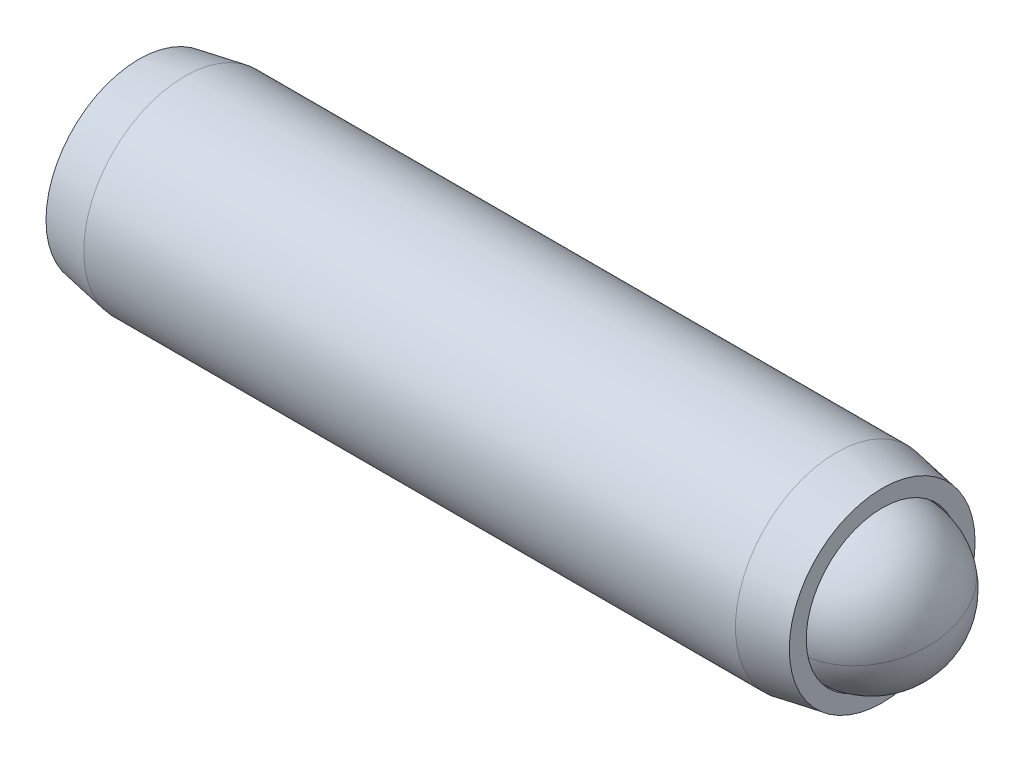
ISO-10303-21;
HEADER;
FILE_DESCRIPTION(('STEP AP214'),'2;1');
FILE_NAME('part.step','',(''),(''),'','','');
FILE_SCHEMA(('AUTOMOTIVE_DESIGN { 1 0 10303 214 1 1 1 1 }'));
ENDSEC;
DATA;
#1=APPLICATION_CONTEXT('core data for automotive mechanical design processes');
#2=APPLICATION_PROTOCOL_DEFINITION('international standard','automotive_design',2000,#1);
#3=PRODUCT_CONTEXT('',#1,'mechanical');
#4=PRODUCT('Part','Part','',(#3));
#5=PRODUCT_RELATED_PRODUCT_CATEGORY('part','',(#4));
#6=PRODUCT_DEFINITION_FORMATION('','',#4);
#7=PRODUCT_DEFINITION_CONTEXT('part definition',#1,'design');
#8=PRODUCT_DEFINITION('design','',#6,#7);
#9=PRODUCT_DEFINITION_SHAPE('','',#8);
#10=(LENGTH_UNIT() NAMED_UNIT(*) SI_UNIT(.MILLI.,.METRE.));
#11=(NAMED_UNIT(*) PLANE_ANGLE_UNIT() SI_UNIT($,.RADIAN.));
#12=(NAMED_UNIT(*) SI_UNIT($,.STERADIAN.) SOLID_ANGLE_UNIT());
#13=UNCERTAINTY_MEASURE_WITH_UNIT(LENGTH_MEASURE(1.E-05),#10,'distance_accuracy_value','');
#14=(GEOMETRIC_REPRESENTATION_CONTEXT(3) GLOBAL_UNCERTAINTY_ASSIGNED_CONTEXT((#13)) GLOBAL_UNIT_ASSIGNED_CONTEXT((#10,
#11,#12)) REPRESENTATION_CONTEXT('',''));
#15=CARTESIAN_POINT('',(0.,0.,0.));
#16=DIRECTION('',(0.,0.,1.));
#17=DIRECTION('',(1.,0.,0.));
#18=AXIS2_PLACEMENT_3D('',#15,#16,#17);
#19=CARTESIAN_POINT('',(5.24980800757996,2.7420499882851,-0.965131231055238));
#20=DIRECTION('',(1.,0.,0.));
#21=DIRECTION('',(0.,1.,0.));
#22=AXIS2_PLACEMENT_3D('',#19,#20,#21);
#23=CONICAL_SURFACE('',#22,0.,0.78539816339745);
#24=CARTESIAN_POINT('',(7.63740800757996,2.7420499882851,-0.965131231055238));
#25=DIRECTION('',(1.,0.,0.));
#26=DIRECTION('',(0.,1.,0.));
#27=AXIS2_PLACEMENT_3D('',#24,#25,#26);
#28=CIRCLE('',#27,2.3876);
#29=CARTESIAN_POINT('',(7.63740800757996,5.1296499882851,-0.965131231055238));
#30=VERTEX_POINT('',#29);
#31=EDGE_CURVE('P0_E149',#30,#30,#28,.T.);
#32=ORIENTED_EDGE('',*,*,#31,.T.);
#33=EDGE_LOOP('',(#32));
#34=FACE_BOUND('',#33,.T.);
#35=CARTESIAN_POINT('',(5.24980800757996,2.7420499882851,-0.965131231055238));
#36=VERTEX_POINT('',#35);
#37=VERTEX_LOOP('',#36);
#38=FACE_BOUND('',#37,.T.);
#39=ADVANCED_FACE('P0_F16',(#34,#38),#23,.F.);
#40=CARTESIAN_POINT('',(5.24980800757996,2.7420499882851,-0.965131231055238));
#41=DIRECTION('',(1.,0.,0.));
#42=DIRECTION('',(0.,1.,0.));
#43=AXIS2_PLACEMENT_3D('',#40,#41,#42);
#44=CYLINDRICAL_SURFACE('',#43,2.3876);
#45=CARTESIAN_POINT('',(8.96665405298089,2.7420499882851,-0.965131231055238));
#46=DIRECTION('',(1.,0.,0.));
#47=DIRECTION('',(0.,1.,0.));
#48=AXIS2_PLACEMENT_3D('',#45,#46,#47);
#49=CIRCLE('',#48,2.3876);
#50=CARTESIAN_POINT('',(8.96665405298089,5.1296499882851,-0.965131231055238));
#51=VERTEX_POINT('',#50);
#52=EDGE_CURVE('P0_E146',#51,#51,#49,.T.);
#53=ORIENTED_EDGE('',*,*,#52,.T.);
#54=EDGE_LOOP('',(#53));
#55=FACE_BOUND('',#54,.T.);
#56=ORIENTED_EDGE('',*,*,#31,.F.);
#57=EDGE_LOOP('',(#56));
#58=FACE_BOUND('',#57,.T.);
#59=ADVANCED_FACE('P0_F224',(#55,#58),#44,.F.);
#60=CARTESIAN_POINT('',(8.96665405298089,5.66304998828509,-0.965131231055238));
#61=DIRECTION('',(1.,0.,0.));
#62=DIRECTION('',(0.,1.,0.));
#63=AXIS2_PLACEMENT_3D('',#60,#61,#62);
#64=PLANE('',#63);
#65=CARTESIAN_POINT('',(8.96665405298089,2.7420499882851,-0.965131231055238));
#66=DIRECTION('',(1.,0.,0.));
#67=DIRECTION('',(0.,1.,0.));
#68=AXIS2_PLACEMENT_3D('',#65,#66,#67);
#69=CIRCLE('',#68,2.921);
#70=CARTESIAN_POINT('',(8.96665405298089,5.66304998828509,-0.965131231055238));
#71=VERTEX_POINT('',#70);
#72=EDGE_CURVE('P0_E143',#71,#71,#69,.T.);
#73=ORIENTED_EDGE('',*,*,#72,.T.);
#74=EDGE_LOOP('',(#73));
#75=FACE_BOUND('',#74,.T.);
#76=ORIENTED_EDGE('',*,*,#52,.F.);
#77=EDGE_LOOP('',(#76));
#78=FACE_BOUND('',#77,.T.);
#79=ADVANCED_FACE('P0_F230',(#75,#78),#64,.T.);
#80=CARTESIAN_POINT('',(8.96665405298089,2.7420499882851,-0.965131231055238));
#81=DIRECTION('',(-1.,0.,0.));
#82=DIRECTION('',(0.,-1.,0.));
#83=AXIS2_PLACEMENT_3D('',#80,#81,#82);
#84=CONICAL_SURFACE('',#83,2.921,0.174532925199434);
#85=CARTESIAN_POINT('',(7.526148470798,2.7420499882851,-0.965131231055238));
#86=DIRECTION('',(1.,0.,0.));
#87=DIRECTION('',(0.,1.,0.));
#88=AXIS2_PLACEMENT_3D('',#85,#86,#87);
#89=CIRCLE('',#88,3.175);
#90=CARTESIAN_POINT('',(7.526148470798,5.91704998828509,-0.965131231055238));
#91=VERTEX_POINT('',#90);
#92=EDGE_CURVE('P0_E140',#91,#91,#89,.T.);
#93=ORIENTED_EDGE('',*,*,#92,.T.);
#94=EDGE_LOOP('',(#93));
#95=FACE_BOUND('',#94,.T.);
#96=ORIENTED_EDGE('',*,*,#72,.F.);
#97=EDGE_LOOP('',(#96));
#98=FACE_BOUND('',#97,.T.);
#99=ADVANCED_FACE('P0_F274',(#95,#98),#84,.T.);
#100=CARTESIAN_POINT('',(5.24980800757996,2.7420499882851,-0.965131231055238));
#101=DIRECTION('',(1.,0.,0.));
#102=DIRECTION('',(0.,1.,0.));
#103=AXIS2_PLACEMENT_3D('',#100,#101,#102);
#104=CYLINDRICAL_SURFACE('',#103,3.175);
#105=CARTESIAN_POINT('',(-12.9608403648362,2.74204998828509,-0.965131231055238));
#106=DIRECTION('',(1.,0.,0.));
#107=DIRECTION('',(0.,1.,0.));
#108=AXIS2_PLACEMENT_3D('',#105,#106,#107);
#109=CIRCLE('',#108,3.175);
#110=CARTESIAN_POINT('',(-12.9608403648362,5.91704998828509,-0.965131231055238));
#111=VERTEX_POINT('',#110);
#112=EDGE_CURVE('P0_E137',#111,#111,#109,.T.);
#113=ORIENTED_EDGE('',*,*,#112,.T.);
#114=EDGE_LOOP('',(#113));
#115=FACE_BOUND('',#114,.T.);
#116=ORIENTED_EDGE('',*,*,#92,.F.);
#117=EDGE_LOOP('',(#116));
#118=FACE_BOUND('',#117,.T.);
#119=ADVANCED_FACE('P0_F270',(#115,#118),#104,.T.);
#120=CARTESIAN_POINT('',(-12.9608403648362,2.74204998828509,-0.965131231055238));
#121=DIRECTION('',(1.,0.,0.));
#122=DIRECTION('',(0.,1.,0.));
#123=AXIS2_PLACEMENT_3D('',#120,#121,#122);
#124=CONICAL_SURFACE('',#123,3.175,0.174532925199434);
#125=CARTESIAN_POINT('',(-14.4013459470191,2.74204998828509,-0.965131231055238));
#126=DIRECTION('',(1.,0.,0.));
#127=DIRECTION('',(0.,1.,0.));
#128=AXIS2_PLACEMENT_3D('',#125,#126,#127);
#129=CIRCLE('',#128,2.921);
#130=CARTESIAN_POINT('',(-14.4013459470191,5.66304998828509,-0.965131231055238));
#131=VERTEX_POINT('',#130);
#132=EDGE_CURVE('P0_E125',#131,#131,#129,.T.);
#133=ORIENTED_EDGE('',*,*,#132,.T.);
#134=EDGE_LOOP('',(#133));
#135=FACE_BOUND('',#134,.T.);
#136=ORIENTED_EDGE('',*,*,#112,.F.);
#137=EDGE_LOOP('',(#136));
#138=FACE_BOUND('',#137,.T.);
#139=ADVANCED_FACE('P0_F266',(#135,#138),#124,.T.);
#140=CARTESIAN_POINT('',(-14.4013459470191,2.74204998828509,-0.965131231055238));
#141=DIRECTION('',(-1.,0.,0.));
#142=DIRECTION('',(0.,-1.,0.));
#143=AXIS2_PLACEMENT_3D('',#140,#141,#142);
#144=PLANE('',#143);
#145=DIRECTION('',(0.,0.866025403784439,-0.5));
#146=VECTOR('',#145,1.);
#147=CARTESIAN_POINT('',(-14.4013459470191,2.6150499882851,-2.33078112403965));
#148=LINE('',#147,#146);
#149=CARTESIAN_POINT('',(-14.4013459470191,1.49586248828509,-1.68461791964099));
#150=VERTEX_POINT('',#149);
#151=CARTESIAN_POINT('',(-14.4013459470191,2.7420499882851,-2.40410460822673));
#152=VERTEX_POINT('',#151);
#153=EDGE_CURVE('P0_E163',#150,#152,#148,.T.);
#154=ORIENTED_EDGE('',*,*,#153,.T.);
#155=DIRECTION('',(0.,0.866025403784439,0.5));
#156=VECTOR('',#155,1.);
#157=CARTESIAN_POINT('',(-14.4013459470191,3.8612374882851,-1.75794140382807));
#158=LINE('',#157,#156);
#159=CARTESIAN_POINT('',(-14.4013459470191,3.9882374882851,-1.68461791964099));
#160=VERTEX_POINT('',#159);
#161=EDGE_CURVE('P0_E165',#152,#160,#158,.T.);
#162=ORIENTED_EDGE('',*,*,#161,.T.);
#163=DIRECTION('',(0.,0.,1.));
#164=VECTOR('',#163,1.);
#165=CARTESIAN_POINT('',(-14.4013459470191,3.9882374882851,-0.392291510843657));
#166=LINE('',#165,#164);
#167=CARTESIAN_POINT('',(-14.4013459470191,3.9882374882851,-0.245644542469492));
#168=VERTEX_POINT('',#167);
#169=EDGE_CURVE('P0_E155',#160,#168,#166,.T.);
#170=ORIENTED_EDGE('',*,*,#169,.T.);
#171=DIRECTION('',(0.,-0.866025403784438,0.5));
#172=VECTOR('',#171,1.);
#173=CARTESIAN_POINT('',(-14.4013459470191,2.8690499882851,0.400518661929173));
#174=LINE('',#173,#172);
#175=CARTESIAN_POINT('',(-14.4013459470191,2.7420499882851,0.473842146116256));
#176=VERTEX_POINT('',#175);
#177=EDGE_CURVE('P0_E157',#168,#176,#174,.T.);
#178=ORIENTED_EDGE('',*,*,#177,.T.);
#179=DIRECTION('',(0.,-0.866025403784439,-0.5));
#180=VECTOR('',#179,1.);
#181=CARTESIAN_POINT('',(-14.4013459470191,1.62286248828509,-0.172321058282409));
#182=LINE('',#181,#180);
#183=CARTESIAN_POINT('',(-14.4013459470191,1.49586248828509,-0.245644542469491));
#184=VERTEX_POINT('',#183);
#185=EDGE_CURVE('P0_E159',#176,#184,#182,.T.);
#186=ORIENTED_EDGE('',*,*,#185,.T.);
#187=DIRECTION('',(0.,0.,-1.));
#188=VECTOR('',#187,1.);
#189=CARTESIAN_POINT('',(-14.4013459470191,1.49586248828509,-1.53797095126682));
#190=LINE('',#189,#188);
#191=EDGE_CURVE('P0_E161',#184,#150,#190,.T.);
#192=ORIENTED_EDGE('',*,*,#191,.T.);
#193=EDGE_LOOP('',(#154,#162,#170,#178,#186,#192));
#194=FACE_BOUND('',#193,.T.);
#195=ORIENTED_EDGE('',*,*,#132,.F.);
#196=EDGE_LOOP('',(#195));
#197=FACE_BOUND('',#196,.T.);
#198=ADVANCED_FACE('P0_F220',(#194,#197),#144,.T.);
#199=CARTESIAN_POINT('',(-11.3533459470191,2.7420499882851,0.180548209367926));
#200=DIRECTION('',(0.,0.5,0.866025403784438));
#201=DIRECTION('',(0.,-0.866025403784438,0.5));
#202=AXIS2_PLACEMENT_3D('',#199,#200,#201);
#203=PLANE('',#202);
#204=DIRECTION('',(-1.,0.,0.));
#205=VECTOR('',#204,1.);
#206=CARTESIAN_POINT('',(-11.3533459470191,2.7420499882851,0.180548209367926));
#207=LINE('',#206,#205);
#208=CARTESIAN_POINT('',(-11.3533459470191,2.7420499882851,0.180548209367926));
#209=VERTEX_POINT('',#208);
#210=CARTESIAN_POINT('',(-14.1473459470191,2.7420499882851,0.180548209367926));
#211=VERTEX_POINT('',#210);
#212=EDGE_CURVE('P0_E123',#209,#211,#207,.T.);
#213=ORIENTED_EDGE('',*,*,#212,.T.);
#214=DIRECTION('',(0.,0.866025403784438,-0.5));
#215=VECTOR('',#214,1.);
#216=CARTESIAN_POINT('',(-14.1473459470191,3.7342374882851,-0.392291510843657));
#217=LINE('',#216,#215);
#218=CARTESIAN_POINT('',(-14.1473459470191,3.7342374882851,-0.392291510843657));
#219=VERTEX_POINT('',#218);
#220=EDGE_CURVE('P0_E25',#211,#219,#217,.T.);
#221=ORIENTED_EDGE('',*,*,#220,.T.);
#222=DIRECTION('',(-1.,0.,0.));
#223=VECTOR('',#222,1.);
#224=CARTESIAN_POINT('',(-11.3533459470191,3.7342374882851,-0.392291510843657));
#225=LINE('',#224,#223);
#226=CARTESIAN_POINT('',(-11.3533459470191,3.7342374882851,-0.392291510843657));
#227=VERTEX_POINT('',#226);
#228=EDGE_CURVE('P0_E89',#227,#219,#225,.T.);
#229=ORIENTED_EDGE('',*,*,#228,.F.);
#230=DIRECTION('',(0.,0.866025403784438,-0.5));
#231=VECTOR('',#230,1.);
#232=CARTESIAN_POINT('',(-11.3533459470191,2.7420499882851,0.180548209367926));
#233=LINE('',#232,#231);
#234=EDGE_CURVE('P0_E93',#209,#227,#233,.T.);
#235=ORIENTED_EDGE('',*,*,#234,.F.);
#236=EDGE_LOOP('',(#213,#221,#229,#235));
#237=FACE_BOUND('',#236,.T.);
#238=ADVANCED_FACE('P0_F91',(#237),#203,.F.);
#239=CARTESIAN_POINT('',(-11.3533459470191,1.7498624882851,-0.392291510843657));
#240=DIRECTION('',(0.,-0.5,0.866025403784439));
#241=DIRECTION('',(0.,-0.866025403784439,-0.5));
#242=AXIS2_PLACEMENT_3D('',#239,#240,#241);
#243=PLANE('',#242);
#244=DIRECTION('',(-1.,0.,0.));
#245=VECTOR('',#244,1.);
#246=CARTESIAN_POINT('',(-11.3533459470191,1.7498624882851,-0.392291510843657));
#247=LINE('',#246,#245);
#248=CARTESIAN_POINT('',(-11.3533459470191,1.7498624882851,-0.392291510843657));
#249=VERTEX_POINT('',#248);
#250=CARTESIAN_POINT('',(-14.1473459470191,1.74986248828509,-0.392291510843657));
#251=VERTEX_POINT('',#250);
#252=EDGE_CURVE('P0_E126',#249,#251,#247,.T.);
#253=ORIENTED_EDGE('',*,*,#252,.T.);
#254=DIRECTION('',(0.,0.866025403784439,0.5));
#255=VECTOR('',#254,1.);
#256=CARTESIAN_POINT('',(-14.1473459470191,2.7420499882851,0.180548209367926));
#257=LINE('',#256,#255);
#258=EDGE_CURVE('P0_E40',#251,#211,#257,.T.);
#259=ORIENTED_EDGE('',*,*,#258,.T.);
#260=ORIENTED_EDGE('',*,*,#212,.F.);
#261=DIRECTION('',(0.,0.866025403784439,0.5));
#262=VECTOR('',#261,1.);
#263=CARTESIAN_POINT('',(-11.3533459470191,1.7498624882851,-0.392291510843657));
#264=LINE('',#263,#262);
#265=EDGE_CURVE('P0_E98',#249,#209,#264,.T.);
#266=ORIENTED_EDGE('',*,*,#265,.F.);
#267=EDGE_LOOP('',(#253,#259,#260,#266));
#268=FACE_BOUND('',#267,.T.);
#269=ADVANCED_FACE('P0_F211',(#268),#243,.F.);
#270=CARTESIAN_POINT('',(-11.3533459470191,1.7498624882851,-1.53797095126682));
#271=DIRECTION('',(0.,-1.,0.));
#272=DIRECTION('',(0.,0.,-1.));
#273=AXIS2_PLACEMENT_3D('',#270,#271,#272);
#274=PLANE('',#273);
#275=DIRECTION('',(-1.,0.,0.));
#276=VECTOR('',#275,1.);
#277=CARTESIAN_POINT('',(-11.3533459470191,1.7498624882851,-1.53797095126682));
#278=LINE('',#277,#276);
#279=CARTESIAN_POINT('',(-11.3533459470191,1.7498624882851,-1.53797095126682));
#280=VERTEX_POINT('',#279);
#281=CARTESIAN_POINT('',(-14.1473459470191,1.74986248828509,-1.53797095126682));
#282=VERTEX_POINT('',#281);
#283=EDGE_CURVE('P0_E128',#280,#282,#278,.T.);
#284=ORIENTED_EDGE('',*,*,#283,.T.);
#285=DIRECTION('',(0.,0.,1.));
#286=VECTOR('',#285,1.);
#287=CARTESIAN_POINT('',(-14.1473459470191,1.74986248828509,-0.392291510843657));
#288=LINE('',#287,#286);
#289=EDGE_CURVE('P0_E170',#282,#251,#288,.T.);
#290=ORIENTED_EDGE('',*,*,#289,.T.);
#291=ORIENTED_EDGE('',*,*,#252,.F.);
#292=DIRECTION('',(0.,0.,1.));
#293=VECTOR('',#292,1.);
#294=CARTESIAN_POINT('',(-11.3533459470191,1.7498624882851,-1.53797095126682));
#295=LINE('',#294,#293);
#296=EDGE_CURVE('P0_E120',#280,#249,#295,.T.);
#297=ORIENTED_EDGE('',*,*,#296,.F.);
#298=EDGE_LOOP('',(#284,#290,#291,#297));
#299=FACE_BOUND('',#298,.T.);
#300=ADVANCED_FACE('P0_F210',(#299),#274,.F.);
#301=CARTESIAN_POINT('',(-11.3533459470191,2.7420499882851,-2.1108106714784));
#302=DIRECTION('',(0.,-0.5,-0.866025403784438));
#303=DIRECTION('',(0.,0.866025403784439,-0.5));
#304=AXIS2_PLACEMENT_3D('',#301,#302,#303);
#305=PLANE('',#304);
#306=DIRECTION('',(-1.,0.,0.));
#307=VECTOR('',#306,1.);
#308=CARTESIAN_POINT('',(-11.3533459470191,2.7420499882851,-2.1108106714784));
#309=LINE('',#308,#307);
#310=CARTESIAN_POINT('',(-11.3533459470191,2.7420499882851,-2.1108106714784));
#311=VERTEX_POINT('',#310);
#312=CARTESIAN_POINT('',(-14.1473459470191,2.7420499882851,-2.1108106714784));
#313=VERTEX_POINT('',#312);
#314=EDGE_CURVE('P0_E131',#311,#313,#309,.T.);
#315=ORIENTED_EDGE('',*,*,#314,.T.);
#316=DIRECTION('',(0.,-0.866025403784439,0.5));
#317=VECTOR('',#316,1.);
#318=CARTESIAN_POINT('',(-14.1473459470191,1.74986248828509,-1.53797095126682));
#319=LINE('',#318,#317);
#320=EDGE_CURVE('P0_E168',#313,#282,#319,.T.);
#321=ORIENTED_EDGE('',*,*,#320,.T.);
#322=ORIENTED_EDGE('',*,*,#283,.F.);
#323=DIRECTION('',(0.,-0.866025403784438,0.5));
#324=VECTOR('',#323,1.);
#325=CARTESIAN_POINT('',(-11.3533459470191,2.7420499882851,-2.1108106714784));
#326=LINE('',#325,#324);
#327=EDGE_CURVE('P0_E117',#311,#280,#326,.T.);
#328=ORIENTED_EDGE('',*,*,#327,.F.);
#329=EDGE_LOOP('',(#315,#321,#322,#328));
#330=FACE_BOUND('',#329,.T.);
#331=ADVANCED_FACE('P0_F207',(#330),#305,.F.);
#332=CARTESIAN_POINT('',(-11.3533459470191,3.7342374882851,-1.53797095126682));
#333=DIRECTION('',(0.,0.5,-0.866025403784439));
#334=DIRECTION('',(0.,0.866025403784439,0.5));
#335=AXIS2_PLACEMENT_3D('',#332,#333,#334);
#336=PLANE('',#335);
#337=DIRECTION('',(-1.,0.,0.));
#338=VECTOR('',#337,1.);
#339=CARTESIAN_POINT('',(-11.3533459470191,3.7342374882851,-1.53797095126682));
#340=LINE('',#339,#338);
#341=CARTESIAN_POINT('',(-11.3533459470191,3.7342374882851,-1.53797095126682));
#342=VERTEX_POINT('',#341);
#343=CARTESIAN_POINT('',(-14.1473459470191,3.7342374882851,-1.53797095126682));
#344=VERTEX_POINT('',#343);
#345=EDGE_CURVE('P0_E97',#342,#344,#340,.T.);
#346=ORIENTED_EDGE('',*,*,#345,.T.);
#347=DIRECTION('',(0.,-0.866025403784439,-0.5));
#348=VECTOR('',#347,1.);
#349=CARTESIAN_POINT('',(-14.1473459470191,2.7420499882851,-2.1108106714784));
#350=LINE('',#349,#348);
#351=EDGE_CURVE('P0_E152',#344,#313,#350,.T.);
#352=ORIENTED_EDGE('',*,*,#351,.T.);
#353=ORIENTED_EDGE('',*,*,#314,.F.);
#354=DIRECTION('',(0.,-0.866025403784439,-0.5));
#355=VECTOR('',#354,1.);
#356=CARTESIAN_POINT('',(-11.3533459470191,3.7342374882851,-1.53797095126682));
#357=LINE('',#356,#355);
#358=EDGE_CURVE('P0_E107',#342,#311,#357,.T.);
#359=ORIENTED_EDGE('',*,*,#358,.F.);
#360=EDGE_LOOP('',(#346,#352,#353,#359));
#361=FACE_BOUND('',#360,.T.);
#362=ADVANCED_FACE('P0_F203',(#361),#336,.F.);
#363=CARTESIAN_POINT('',(-11.3533459470191,3.7342374882851,-0.392291510843657));
#364=DIRECTION('',(0.,1.,0.));
#365=DIRECTION('',(0.,0.,1.));
#366=AXIS2_PLACEMENT_3D('',#363,#364,#365);
#367=PLANE('',#366);
#368=ORIENTED_EDGE('',*,*,#228,.T.);
#369=DIRECTION('',(0.,0.,-1.));
#370=VECTOR('',#369,1.);
#371=CARTESIAN_POINT('',(-14.1473459470191,3.7342374882851,-1.53797095126682));
#372=LINE('',#371,#370);
#373=EDGE_CURVE('P0_E11',#219,#344,#372,.T.);
#374=ORIENTED_EDGE('',*,*,#373,.T.);
#375=ORIENTED_EDGE('',*,*,#345,.F.);
#376=DIRECTION('',(0.,0.,-1.));
#377=VECTOR('',#376,1.);
#378=CARTESIAN_POINT('',(-11.3533459470191,3.7342374882851,-0.392291510843657));
#379=LINE('',#378,#377);
#380=EDGE_CURVE('P0_E101',#227,#342,#379,.T.);
#381=ORIENTED_EDGE('',*,*,#380,.F.);
#382=EDGE_LOOP('',(#368,#374,#375,#381));
#383=FACE_BOUND('',#382,.T.);
#384=ADVANCED_FACE('P0_F102',(#383),#367,.F.);
#385=CARTESIAN_POINT('',(-11.3533459470191,4.7264249882851,-0.965131231055239));
#386=DIRECTION('',(-1.,0.,0.));
#387=DIRECTION('',(0.,0.,1.));
#388=AXIS2_PLACEMENT_3D('',#385,#386,#387);
#389=PLANE('',#388);
#390=ORIENTED_EDGE('',*,*,#234,.T.);
#391=ORIENTED_EDGE('',*,*,#380,.T.);
#392=ORIENTED_EDGE('',*,*,#358,.T.);
#393=ORIENTED_EDGE('',*,*,#327,.T.);
#394=ORIENTED_EDGE('',*,*,#296,.T.);
#395=ORIENTED_EDGE('',*,*,#265,.T.);
#396=EDGE_LOOP('',(#390,#391,#392,#393,#394,#395));
#397=FACE_BOUND('',#396,.T.);
#398=ADVANCED_FACE('P0_F109',(#397),#389,.T.);
#399=CARTESIAN_POINT('',(-14.1473459470191,1.7498624882851,-0.392291510843656));
#400=DIRECTION('',(-0.707106781186547,0.353553390593274,-0.612372435695795));
#401=DIRECTION('',(-0.654653670707977,0.,0.755928946018454));
#402=AXIS2_PLACEMENT_3D('',#399,#400,#401);
#403=PLANE('',#402);
#404=DIRECTION('',(-0.654653670707977,-0.654653670707977,0.377964473009228));
#405=VECTOR('',#404,1.);
#406=CARTESIAN_POINT('',(-13.863863804162,2.03334463114224,-0.55596000233268));
#407=LINE('',#406,#405);
#408=EDGE_CURVE('P0_E114',#184,#251,#407,.F.);
#409=ORIENTED_EDGE('',*,*,#408,.F.);
#410=ORIENTED_EDGE('',*,*,#185,.F.);
#411=DIRECTION('',(-0.654653670707977,0.,0.755928946018454));
#412=VECTOR('',#411,1.);
#413=CARTESIAN_POINT('',(-13.863863804162,2.7420499882851,-0.146788773610121));
#414=LINE('',#413,#412);
#415=EDGE_CURVE('P0_E20',#211,#176,#414,.T.);
#416=ORIENTED_EDGE('',*,*,#415,.F.);
#417=ORIENTED_EDGE('',*,*,#258,.F.);
#418=EDGE_LOOP('',(#409,#410,#416,#417));
#419=FACE_BOUND('',#418,.T.);
#420=ADVANCED_FACE('P0_F18',(#419),#403,.T.);
#421=CARTESIAN_POINT('',(-14.1473459470191,2.7420499882851,0.180548209367926));
#422=DIRECTION('',(-0.707106781186547,-0.353553390593274,-0.612372435695795));
#423=DIRECTION('',(-0.654653670707978,0.,0.755928946018454));
#424=AXIS2_PLACEMENT_3D('',#421,#422,#423);
#425=PLANE('',#424);
#426=ORIENTED_EDGE('',*,*,#415,.T.);
#427=ORIENTED_EDGE('',*,*,#177,.F.);
#428=DIRECTION('',(-0.654653670707977,0.654653670707978,0.377964473009226));
#429=VECTOR('',#428,1.);
#430=CARTESIAN_POINT('',(-13.863863804162,3.45075534542795,-0.55596000233268));
#431=LINE('',#430,#429);
#432=EDGE_CURVE('P0_E181',#219,#168,#431,.T.);
#433=ORIENTED_EDGE('',*,*,#432,.F.);
#434=ORIENTED_EDGE('',*,*,#220,.F.);
#435=EDGE_LOOP('',(#426,#427,#433,#434));
#436=FACE_BOUND('',#435,.T.);
#437=ADVANCED_FACE('P0_F195',(#436),#425,.T.);
#438=CARTESIAN_POINT('',(-14.1473459470191,1.74986248828509,-1.53797095126682));
#439=DIRECTION('',(-0.707106781186547,0.707106781186548,0.));
#440=DIRECTION('',(-0.707106781186548,-0.707106781186547,0.));
#441=AXIS2_PLACEMENT_3D('',#438,#439,#440);
#442=PLANE('',#441);
#443=ORIENTED_EDGE('',*,*,#408,.T.);
#444=ORIENTED_EDGE('',*,*,#289,.F.);
#445=DIRECTION('',(-0.654653670707977,-0.654653670707977,-0.377964473009227));
#446=VECTOR('',#445,1.);
#447=CARTESIAN_POINT('',(-13.863863804162,2.03334463114224,-1.3743024597778));
#448=LINE('',#447,#446);
#449=EDGE_CURVE('P0_E178',#150,#282,#448,.F.);
#450=ORIENTED_EDGE('',*,*,#449,.F.);
#451=ORIENTED_EDGE('',*,*,#191,.F.);
#452=EDGE_LOOP('',(#443,#444,#450,#451));
#453=FACE_BOUND('',#452,.T.);
#454=ADVANCED_FACE('P0_F188',(#453),#442,.T.);
#455=CARTESIAN_POINT('',(-14.1473459470191,3.7342374882851,-0.392291510843657));
#456=DIRECTION('',(-0.707106781186548,-0.707106781186547,0.));
#457=DIRECTION('',(0.707106781186547,-0.707106781186548,0.));
#458=AXIS2_PLACEMENT_3D('',#455,#456,#457);
#459=PLANE('',#458);
#460=ORIENTED_EDGE('',*,*,#432,.T.);
#461=ORIENTED_EDGE('',*,*,#169,.F.);
#462=DIRECTION('',(0.654653670707977,-0.654653670707977,0.377964473009227));
#463=VECTOR('',#462,1.);
#464=CARTESIAN_POINT('',(-14.1473459470191,3.7342374882851,-1.53797095126682));
#465=LINE('',#464,#463);
#466=EDGE_CURVE('P0_E176',#344,#160,#465,.F.);
#467=ORIENTED_EDGE('',*,*,#466,.F.);
#468=ORIENTED_EDGE('',*,*,#373,.F.);
#469=EDGE_LOOP('',(#460,#461,#467,#468));
#470=FACE_BOUND('',#469,.T.);
#471=ADVANCED_FACE('P0_F200',(#470),#459,.T.);
#472=CARTESIAN_POINT('',(-14.1473459470191,2.7420499882851,-2.1108106714784));
#473=DIRECTION('',(-0.707106781186547,0.353553390593274,0.612372435695795));
#474=DIRECTION('',(0.654653670707977,0.,0.755928946018454));
#475=AXIS2_PLACEMENT_3D('',#472,#473,#474);
#476=PLANE('',#475);
#477=ORIENTED_EDGE('',*,*,#449,.T.);
#478=ORIENTED_EDGE('',*,*,#320,.F.);
#479=DIRECTION('',(-0.654653670707977,0.,-0.755928946018454));
#480=VECTOR('',#479,1.);
#481=CARTESIAN_POINT('',(-13.863863804162,2.7420499882851,-1.78347368850036));
#482=LINE('',#481,#480);
#483=EDGE_CURVE('P0_E174',#152,#313,#482,.F.);
#484=ORIENTED_EDGE('',*,*,#483,.F.);
#485=ORIENTED_EDGE('',*,*,#153,.F.);
#486=EDGE_LOOP('',(#477,#478,#484,#485));
#487=FACE_BOUND('',#486,.T.);
#488=ADVANCED_FACE('P0_F239',(#487),#476,.T.);
#489=CARTESIAN_POINT('',(-14.1473459470191,3.7342374882851,-1.53797095126682));
#490=DIRECTION('',(-0.707106781186547,-0.353553390593274,0.612372435695795));
#491=DIRECTION('',(0.654653670707978,0.,0.755928946018454));
#492=AXIS2_PLACEMENT_3D('',#489,#490,#491);
#493=PLANE('',#492);
#494=ORIENTED_EDGE('',*,*,#466,.T.);
#495=ORIENTED_EDGE('',*,*,#161,.F.);
#496=ORIENTED_EDGE('',*,*,#483,.T.);
#497=ORIENTED_EDGE('',*,*,#351,.F.);
#498=EDGE_LOOP('',(#494,#495,#496,#497));
#499=FACE_BOUND('',#498,.T.);
#500=ADVANCED_FACE('P0_F236',(#499),#493,.T.);
#501=CLOSED_SHELL('',(#39,#59,#79,#99,#119,#139,#198,#238,#269,#300,#331,#362,#384,#398,#420,
#437,#454,#471,#488,#500));
#502=MANIFOLD_SOLID_BREP('P0_B1',#501);
#503=CARTESIAN_POINT('',(8.61740405298089,2.7420499882851,-0.965131231055238));
#504=DIRECTION('',(0.,0.972214232741158,0.234092899626454));
#505=DIRECTION('',(0.,0.234092899626454,-0.972214232741158));
#506=AXIS2_PLACEMENT_3D('',#503,#504,#505);
#507=SPHERICAL_SURFACE('',#506,2.38125);
#508=CARTESIAN_POINT('',(8.61740405298089,2.7420499882851,-0.965131231055238));
#509=DIRECTION('',(1.,0.,0.));
#510=DIRECTION('',(0.,0.234092899626454,-0.972214232741158));
#511=AXIS2_PLACEMENT_3D('',#508,#509,#510);
#512=CIRCLE('',#511,2.38125);
#513=CARTESIAN_POINT('',(8.61740405298089,3.29948370552059,-3.28021637277012));
#514=VERTEX_POINT('',#513);
#515=CARTESIAN_POINT('',(8.61740405298089,2.18461627104961,1.34995391065964));
#516=VERTEX_POINT('',#515);
#517=EDGE_CURVE('P1_E33',#514,#516,#512,.T.);
#518=ORIENTED_EDGE('',*,*,#517,.T.);
#519=CARTESIAN_POINT('',(8.61740405298089,2.7420499882851,-0.965131231055238));
#520=DIRECTION('',(0.,0.972214232741158,0.234092899626454));
#521=DIRECTION('',(1.,0.,0.));
#522=AXIS2_PLACEMENT_3D('',#519,#520,#521);
#523=CIRCLE('',#522,2.38125);
#524=EDGE_CURVE('P1_E11',#516,#514,#523,.T.);
#525=ORIENTED_EDGE('',*,*,#524,.T.);
#526=EDGE_LOOP('',(#518,#525));
#527=FACE_BOUND('',#526,.T.);
#528=ADVANCED_FACE('P1_F16',(#527),#507,.T.);
#529=ORIENTED_EDGE('',*,*,#517,.F.);
#530=CARTESIAN_POINT('',(8.61740405298089,2.7420499882851,-0.965131231055238));
#531=DIRECTION('',(0.,0.972214232741158,0.234092899626454));
#532=DIRECTION('',(1.,0.,0.));
#533=AXIS2_PLACEMENT_3D('',#530,#531,#532);
#534=CIRCLE('',#533,2.38125);
#535=EDGE_CURVE('P1_E23',#514,#516,#534,.T.);
#536=ORIENTED_EDGE('',*,*,#535,.T.);
#537=EDGE_LOOP('',(#529,#536));
#538=FACE_BOUND('',#537,.T.);
#539=ADVANCED_FACE('P1_F40',(#538),#507,.T.);
#540=ORIENTED_EDGE('',*,*,#524,.F.);
#541=EDGE_CURVE('P1_E36',#516,#514,#512,.T.);
#542=ORIENTED_EDGE('',*,*,#541,.T.);
#543=EDGE_LOOP('',(#540,#542));
#544=FACE_BOUND('',#543,.T.);
#545=ADVANCED_FACE('P1_F38',(#544),#507,.T.);
#546=ORIENTED_EDGE('',*,*,#535,.F.);
#547=ORIENTED_EDGE('',*,*,#541,.F.);
#548=EDGE_LOOP('',(#546,#547));
#549=FACE_BOUND('',#548,.T.);
#550=ADVANCED_FACE('P1_F18',(#549),#507,.T.);
#551=CLOSED_SHELL('',(#528,#539,#545,#550));
#552=MANIFOLD_SOLID_BREP('P1_B1',#551);
#553=ADVANCED_BREP_SHAPE_REPRESENTATION('',(#18,#502,#552),#14);
#554=SHAPE_DEFINITION_REPRESENTATION(#9,#553);
ENDSEC;
END-ISO-10303-21;
